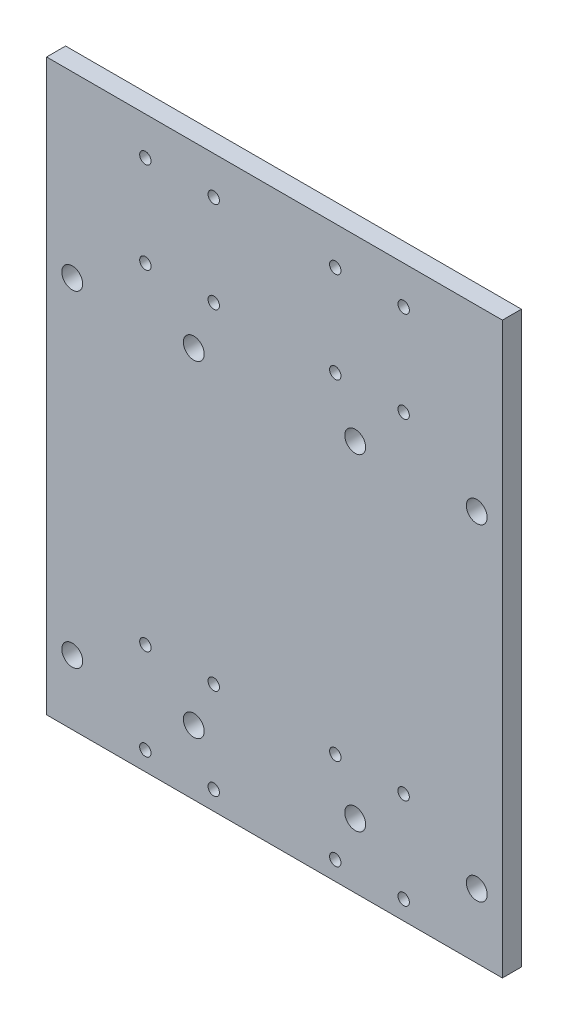
ISO-10303-21;
HEADER;
FILE_DESCRIPTION(('STEP AP214'),'2;1');
FILE_NAME('part.step','',(''),(''),'','','');
FILE_SCHEMA(('AUTOMOTIVE_DESIGN { 1 0 10303 214 1 1 1 1 }'));
ENDSEC;
DATA;
#1=APPLICATION_CONTEXT('core data for automotive mechanical design processes');
#2=APPLICATION_PROTOCOL_DEFINITION('international standard','automotive_design',2000,#1);
#3=PRODUCT_CONTEXT('',#1,'mechanical');
#4=PRODUCT('Part','Part','',(#3));
#5=PRODUCT_RELATED_PRODUCT_CATEGORY('part','',(#4));
#6=PRODUCT_DEFINITION_FORMATION('','',#4);
#7=PRODUCT_DEFINITION_CONTEXT('part definition',#1,'design');
#8=PRODUCT_DEFINITION('design','',#6,#7);
#9=PRODUCT_DEFINITION_SHAPE('','',#8);
#10=(LENGTH_UNIT() NAMED_UNIT(*) SI_UNIT(.MILLI.,.METRE.));
#11=(NAMED_UNIT(*) PLANE_ANGLE_UNIT() SI_UNIT($,.RADIAN.));
#12=(NAMED_UNIT(*) SI_UNIT($,.STERADIAN.) SOLID_ANGLE_UNIT());
#13=UNCERTAINTY_MEASURE_WITH_UNIT(LENGTH_MEASURE(1.E-05),#10,'distance_accuracy_value','');
#14=(GEOMETRIC_REPRESENTATION_CONTEXT(3) GLOBAL_UNCERTAINTY_ASSIGNED_CONTEXT((#13)) GLOBAL_UNIT_ASSIGNED_CONTEXT((#10,
#11,#12)) REPRESENTATION_CONTEXT('',''));
#15=CARTESIAN_POINT('',(0.,0.,0.));
#16=DIRECTION('',(0.,0.,1.));
#17=DIRECTION('',(1.,0.,0.));
#18=AXIS2_PLACEMENT_3D('',#15,#16,#17);
#19=CARTESIAN_POINT('',(-60.,-75.0000000000001,5.));
#20=DIRECTION('',(1.,0.,0.));
#21=DIRECTION('',(0.,0.,-1.));
#22=AXIS2_PLACEMENT_3D('',#19,#20,#21);
#23=PLANE('',#22);
#24=DIRECTION('',(0.,-1.,0.));
#25=VECTOR('',#24,1.);
#26=CARTESIAN_POINT('',(-60.,-75.0000000000001,0.));
#27=LINE('',#26,#25);
#28=CARTESIAN_POINT('',(-60.,75.,0.));
#29=VERTEX_POINT('',#28);
#30=CARTESIAN_POINT('',(-60.,-75.0000000000001,0.));
#31=VERTEX_POINT('',#30);
#32=EDGE_CURVE('E100',#29,#31,#27,.T.);
#33=ORIENTED_EDGE('',*,*,#32,.T.);
#34=DIRECTION('',(0.,0.,-1.));
#35=VECTOR('',#34,1.);
#36=CARTESIAN_POINT('',(-60.,-75.0000000000001,5.));
#37=LINE('',#36,#35);
#38=CARTESIAN_POINT('',(-60.,-75.0000000000001,5.));
#39=VERTEX_POINT('',#38);
#40=EDGE_CURVE('E11',#39,#31,#37,.T.);
#41=ORIENTED_EDGE('',*,*,#40,.F.);
#42=DIRECTION('',(0.,-1.,0.));
#43=VECTOR('',#42,1.);
#44=CARTESIAN_POINT('',(-60.,-75.0000000000001,5.));
#45=LINE('',#44,#43);
#46=CARTESIAN_POINT('',(-60.,75.,5.));
#47=VERTEX_POINT('',#46);
#48=EDGE_CURVE('E88',#47,#39,#45,.T.);
#49=ORIENTED_EDGE('',*,*,#48,.F.);
#50=DIRECTION('',(0.,0.,-1.));
#51=VECTOR('',#50,1.);
#52=CARTESIAN_POINT('',(-60.,75.,5.));
#53=LINE('',#52,#51);
#54=EDGE_CURVE('E96',#47,#29,#53,.T.);
#55=ORIENTED_EDGE('',*,*,#54,.T.);
#56=EDGE_LOOP('',(#33,#41,#49,#55));
#57=FACE_BOUND('',#56,.T.);
#58=ADVANCED_FACE('F37',(#57),#23,.F.);
#59=CARTESIAN_POINT('',(60.,-75.,5.));
#60=DIRECTION('',(0.,1.,0.));
#61=DIRECTION('',(-1.,0.,0.));
#62=AXIS2_PLACEMENT_3D('',#59,#60,#61);
#63=PLANE('',#62);
#64=DIRECTION('',(1.,0.,0.));
#65=VECTOR('',#64,1.);
#66=CARTESIAN_POINT('',(60.,-75.,0.));
#67=LINE('',#66,#65);
#68=CARTESIAN_POINT('',(60.,-75.,0.));
#69=VERTEX_POINT('',#68);
#70=EDGE_CURVE('E92',#31,#69,#67,.T.);
#71=ORIENTED_EDGE('',*,*,#70,.T.);
#72=DIRECTION('',(0.,0.,-1.));
#73=VECTOR('',#72,1.);
#74=CARTESIAN_POINT('',(60.,-75.,5.));
#75=LINE('',#74,#73);
#76=CARTESIAN_POINT('',(60.,-75.,5.));
#77=VERTEX_POINT('',#76);
#78=EDGE_CURVE('E45',#77,#69,#75,.T.);
#79=ORIENTED_EDGE('',*,*,#78,.F.);
#80=DIRECTION('',(1.,0.,0.));
#81=VECTOR('',#80,1.);
#82=CARTESIAN_POINT('',(60.,-75.,5.));
#83=LINE('',#82,#81);
#84=EDGE_CURVE('E83',#39,#77,#83,.T.);
#85=ORIENTED_EDGE('',*,*,#84,.F.);
#86=ORIENTED_EDGE('',*,*,#40,.T.);
#87=EDGE_LOOP('',(#71,#79,#85,#86));
#88=FACE_BOUND('',#87,.T.);
#89=ADVANCED_FACE('F91',(#88),#63,.F.);
#90=CARTESIAN_POINT('',(60.,-75.,5.));
#91=DIRECTION('',(-1.,0.,0.));
#92=DIRECTION('',(0.,0.,1.));
#93=AXIS2_PLACEMENT_3D('',#90,#91,#92);
#94=PLANE('',#93);
#95=DIRECTION('',(0.,1.,0.));
#96=VECTOR('',#95,1.);
#97=CARTESIAN_POINT('',(60.,-75.,0.));
#98=LINE('',#97,#96);
#99=CARTESIAN_POINT('',(60.,75.,0.));
#100=VERTEX_POINT('',#99);
#101=EDGE_CURVE('E70',#69,#100,#98,.T.);
#102=ORIENTED_EDGE('',*,*,#101,.T.);
#103=DIRECTION('',(0.,0.,-1.));
#104=VECTOR('',#103,1.);
#105=CARTESIAN_POINT('',(60.,75.,5.));
#106=LINE('',#105,#104);
#107=CARTESIAN_POINT('',(60.,75.,5.));
#108=VERTEX_POINT('',#107);
#109=EDGE_CURVE('E93',#108,#100,#106,.T.);
#110=ORIENTED_EDGE('',*,*,#109,.F.);
#111=DIRECTION('',(0.,1.,0.));
#112=VECTOR('',#111,1.);
#113=CARTESIAN_POINT('',(60.,-75.,5.));
#114=LINE('',#113,#112);
#115=EDGE_CURVE('E86',#77,#108,#114,.T.);
#116=ORIENTED_EDGE('',*,*,#115,.F.);
#117=ORIENTED_EDGE('',*,*,#78,.T.);
#118=EDGE_LOOP('',(#102,#110,#116,#117));
#119=FACE_BOUND('',#118,.T.);
#120=ADVANCED_FACE('F94',(#119),#94,.F.);
#121=CARTESIAN_POINT('',(60.,75.,5.));
#122=DIRECTION('',(0.,-1.,0.));
#123=DIRECTION('',(1.,0.,0.));
#124=AXIS2_PLACEMENT_3D('',#121,#122,#123);
#125=PLANE('',#124);
#126=DIRECTION('',(-1.,0.,0.));
#127=VECTOR('',#126,1.);
#128=CARTESIAN_POINT('',(60.,75.,0.));
#129=LINE('',#128,#127);
#130=EDGE_CURVE('E76',#100,#29,#129,.T.);
#131=ORIENTED_EDGE('',*,*,#130,.T.);
#132=ORIENTED_EDGE('',*,*,#54,.F.);
#133=DIRECTION('',(-1.,0.,0.));
#134=VECTOR('',#133,1.);
#135=CARTESIAN_POINT('',(60.,75.,5.));
#136=LINE('',#135,#134);
#137=EDGE_CURVE('E53',#108,#47,#136,.T.);
#138=ORIENTED_EDGE('',*,*,#137,.F.);
#139=ORIENTED_EDGE('',*,*,#109,.T.);
#140=EDGE_LOOP('',(#131,#132,#138,#139));
#141=FACE_BOUND('',#140,.T.);
#142=ADVANCED_FACE('F108',(#141),#125,.F.);
#143=CARTESIAN_POINT('',(0.,0.,5.));
#144=DIRECTION('',(0.,0.,1.));
#145=DIRECTION('',(1.,0.,0.));
#146=AXIS2_PLACEMENT_3D('',#143,#144,#145);
#147=PLANE('',#146);
#148=CARTESIAN_POINT('',(16.0000000000002,-45.9999999999992,5.));
#149=DIRECTION('',(0.,0.,-1.));
#150=DIRECTION('',(-1.,0.,0.));
#151=AXIS2_PLACEMENT_3D('',#148,#149,#150);
#152=CIRCLE('',#151,1.5);
#153=CARTESIAN_POINT('',(14.5000000000002,-45.9999999999992,5.));
#154=VERTEX_POINT('',#153);
#155=EDGE_CURVE('E184',#154,#154,#152,.T.);
#156=ORIENTED_EDGE('',*,*,#155,.T.);
#157=EDGE_LOOP('',(#156));
#158=FACE_BOUND('',#157,.T.);
#159=CARTESIAN_POINT('',(34.0000000000003,-69.9999999999991,5.));
#160=DIRECTION('',(0.,0.,-1.));
#161=DIRECTION('',(-1.,0.,0.));
#162=AXIS2_PLACEMENT_3D('',#159,#160,#161);
#163=CIRCLE('',#162,1.5);
#164=CARTESIAN_POINT('',(32.5000000000002,-69.9999999999991,5.));
#165=VERTEX_POINT('',#164);
#166=EDGE_CURVE('E195',#165,#165,#163,.T.);
#167=ORIENTED_EDGE('',*,*,#166,.T.);
#168=EDGE_LOOP('',(#167));
#169=FACE_BOUND('',#168,.T.);
#170=CARTESIAN_POINT('',(34.0000000000002,-45.9999999999991,5.));
#171=DIRECTION('',(0.,0.,-1.));
#172=DIRECTION('',(-1.,0.,0.));
#173=AXIS2_PLACEMENT_3D('',#170,#171,#172);
#174=CIRCLE('',#173,1.5);
#175=CARTESIAN_POINT('',(32.5000000000002,-45.9999999999991,5.));
#176=VERTEX_POINT('',#175);
#177=EDGE_CURVE('E196',#176,#176,#174,.T.);
#178=ORIENTED_EDGE('',*,*,#177,.T.);
#179=EDGE_LOOP('',(#178));
#180=FACE_BOUND('',#179,.T.);
#181=CARTESIAN_POINT('',(15.9999999999999,41.,5.));
#182=DIRECTION('',(0.,0.,-1.));
#183=DIRECTION('',(-1.,0.,0.));
#184=AXIS2_PLACEMENT_3D('',#181,#182,#183);
#185=CIRCLE('',#184,1.5);
#186=CARTESIAN_POINT('',(14.4999999999999,41.,5.));
#187=VERTEX_POINT('',#186);
#188=EDGE_CURVE('E207',#187,#187,#185,.T.);
#189=ORIENTED_EDGE('',*,*,#188,.T.);
#190=EDGE_LOOP('',(#189));
#191=FACE_BOUND('',#190,.T.);
#192=CARTESIAN_POINT('',(-33.9999999999998,-45.9999999999994,5.));
#193=DIRECTION('',(0.,0.,-1.));
#194=DIRECTION('',(-1.,0.,0.));
#195=AXIS2_PLACEMENT_3D('',#192,#193,#194);
#196=CIRCLE('',#195,1.5);
#197=CARTESIAN_POINT('',(-35.4999999999998,-45.9999999999994,5.));
#198=VERTEX_POINT('',#197);
#199=EDGE_CURVE('E165',#198,#198,#196,.T.);
#200=ORIENTED_EDGE('',*,*,#199,.T.);
#201=EDGE_LOOP('',(#200));
#202=FACE_BOUND('',#201,.T.);
#203=CARTESIAN_POINT('',(-15.9999999999997,-69.9999999999993,5.));
#204=DIRECTION('',(0.,0.,-1.));
#205=DIRECTION('',(-1.,0.,0.));
#206=AXIS2_PLACEMENT_3D('',#203,#204,#205);
#207=CIRCLE('',#206,1.5);
#208=CARTESIAN_POINT('',(-17.4999999999997,-69.9999999999993,5.));
#209=VERTEX_POINT('',#208);
#210=EDGE_CURVE('E171',#209,#209,#207,.T.);
#211=ORIENTED_EDGE('',*,*,#210,.T.);
#212=EDGE_LOOP('',(#211));
#213=FACE_BOUND('',#212,.T.);
#214=CARTESIAN_POINT('',(-15.9999999999998,-45.9999999999993,5.));
#215=DIRECTION('',(0.,0.,-1.));
#216=DIRECTION('',(-1.,0.,0.));
#217=AXIS2_PLACEMENT_3D('',#214,#215,#216);
#218=CIRCLE('',#217,1.5);
#219=CARTESIAN_POINT('',(-17.4999999999998,-45.9999999999993,5.));
#220=VERTEX_POINT('',#219);
#221=EDGE_CURVE('E172',#220,#220,#218,.T.);
#222=ORIENTED_EDGE('',*,*,#221,.T.);
#223=EDGE_LOOP('',(#222));
#224=FACE_BOUND('',#223,.T.);
#225=CARTESIAN_POINT('',(16.0000000000003,-69.9999999999992,5.));
#226=DIRECTION('',(0.,0.,-1.));
#227=DIRECTION('',(-1.,0.,0.));
#228=AXIS2_PLACEMENT_3D('',#225,#226,#227);
#229=CIRCLE('',#228,1.5);
#230=CARTESIAN_POINT('',(14.5000000000003,-69.9999999999992,5.));
#231=VERTEX_POINT('',#230);
#232=EDGE_CURVE('E183',#231,#231,#229,.T.);
#233=ORIENTED_EDGE('',*,*,#232,.T.);
#234=EDGE_LOOP('',(#233));
#235=FACE_BOUND('',#234,.T.);
#236=CARTESIAN_POINT('',(-34.0000000000002,64.9999999999998,5.));
#237=DIRECTION('',(0.,0.,-1.));
#238=DIRECTION('',(-1.,0.,0.));
#239=AXIS2_PLACEMENT_3D('',#236,#237,#238);
#240=CIRCLE('',#239,1.5);
#241=CARTESIAN_POINT('',(-35.5000000000002,64.9999999999998,5.));
#242=VERTEX_POINT('',#241);
#243=EDGE_CURVE('E232',#242,#242,#240,.T.);
#244=ORIENTED_EDGE('',*,*,#243,.T.);
#245=EDGE_LOOP('',(#244));
#246=FACE_BOUND('',#245,.T.);
#247=CARTESIAN_POINT('',(-16.0000000000001,40.9999999999999,5.));
#248=DIRECTION('',(0.,0.,-1.));
#249=DIRECTION('',(-1.,0.,0.));
#250=AXIS2_PLACEMENT_3D('',#247,#248,#249);
#251=CIRCLE('',#250,1.5);
#252=CARTESIAN_POINT('',(-17.5000000000001,40.9999999999999,5.));
#253=VERTEX_POINT('',#252);
#254=EDGE_CURVE('E243',#253,#253,#251,.T.);
#255=ORIENTED_EDGE('',*,*,#254,.T.);
#256=EDGE_LOOP('',(#255));
#257=FACE_BOUND('',#256,.T.);
#258=CARTESIAN_POINT('',(-16.0000000000002,64.9999999999999,5.));
#259=DIRECTION('',(0.,0.,-1.));
#260=DIRECTION('',(-1.,0.,0.));
#261=AXIS2_PLACEMENT_3D('',#258,#259,#260);
#262=CIRCLE('',#261,1.5);
#263=CARTESIAN_POINT('',(-17.5000000000002,64.9999999999999,5.));
#264=VERTEX_POINT('',#263);
#265=EDGE_CURVE('E244',#264,#264,#262,.T.);
#266=ORIENTED_EDGE('',*,*,#265,.T.);
#267=EDGE_LOOP('',(#266));
#268=FACE_BOUND('',#267,.T.);
#269=CARTESIAN_POINT('',(15.9999999999998,65.,5.));
#270=DIRECTION('',(0.,0.,-1.));
#271=DIRECTION('',(-1.,0.,0.));
#272=AXIS2_PLACEMENT_3D('',#269,#270,#271);
#273=CIRCLE('',#272,1.5);
#274=CARTESIAN_POINT('',(14.4999999999998,65.,5.));
#275=VERTEX_POINT('',#274);
#276=EDGE_CURVE('E208',#275,#275,#273,.T.);
#277=ORIENTED_EDGE('',*,*,#276,.T.);
#278=EDGE_LOOP('',(#277));
#279=FACE_BOUND('',#278,.T.);
#280=CARTESIAN_POINT('',(33.9999999999999,41.0000000000001,5.));
#281=DIRECTION('',(0.,0.,-1.));
#282=DIRECTION('',(-1.,0.,0.));
#283=AXIS2_PLACEMENT_3D('',#280,#281,#282);
#284=CIRCLE('',#283,1.5);
#285=CARTESIAN_POINT('',(32.4999999999999,41.0000000000001,5.));
#286=VERTEX_POINT('',#285);
#287=EDGE_CURVE('E219',#286,#286,#284,.T.);
#288=ORIENTED_EDGE('',*,*,#287,.T.);
#289=EDGE_LOOP('',(#288));
#290=FACE_BOUND('',#289,.T.);
#291=CARTESIAN_POINT('',(33.9999999999998,65.0000000000001,5.));
#292=DIRECTION('',(0.,0.,-1.));
#293=DIRECTION('',(-1.,0.,0.));
#294=AXIS2_PLACEMENT_3D('',#291,#292,#293);
#295=CIRCLE('',#294,1.5);
#296=CARTESIAN_POINT('',(32.4999999999998,65.0000000000001,5.));
#297=VERTEX_POINT('',#296);
#298=EDGE_CURVE('E220',#297,#297,#295,.T.);
#299=ORIENTED_EDGE('',*,*,#298,.T.);
#300=EDGE_LOOP('',(#299));
#301=FACE_BOUND('',#300,.T.);
#302=CARTESIAN_POINT('',(-34.0000000000001,40.9999999999998,5.));
#303=DIRECTION('',(0.,0.,-1.));
#304=DIRECTION('',(-1.,0.,0.));
#305=AXIS2_PLACEMENT_3D('',#302,#303,#304);
#306=CIRCLE('',#305,1.5);
#307=CARTESIAN_POINT('',(-35.5000000000001,40.9999999999998,5.));
#308=VERTEX_POINT('',#307);
#309=EDGE_CURVE('E231',#308,#308,#306,.T.);
#310=ORIENTED_EDGE('',*,*,#309,.T.);
#311=EDGE_LOOP('',(#310));
#312=FACE_BOUND('',#311,.T.);
#313=CARTESIAN_POINT('',(-33.9999999999997,-69.9999999999994,5.));
#314=DIRECTION('',(0.,0.,-1.));
#315=DIRECTION('',(-1.,0.,0.));
#316=AXIS2_PLACEMENT_3D('',#313,#314,#315);
#317=CIRCLE('',#316,1.5);
#318=CARTESIAN_POINT('',(-35.4999999999997,-69.9999999999994,5.));
#319=VERTEX_POINT('',#318);
#320=EDGE_CURVE('E159',#319,#319,#317,.T.);
#321=ORIENTED_EDGE('',*,*,#320,.T.);
#322=EDGE_LOOP('',(#321));
#323=FACE_BOUND('',#322,.T.);
#324=CARTESIAN_POINT('',(53.2500000000004,-57.9999999999989,5.));
#325=DIRECTION('',(0.,0.,1.));
#326=DIRECTION('',(1.,0.,0.));
#327=AXIS2_PLACEMENT_3D('',#324,#325,#326);
#328=CIRCLE('',#327,2.75);
#329=CARTESIAN_POINT('',(56.0000000000004,-57.9999999999989,5.));
#330=VERTEX_POINT('',#329);
#331=EDGE_CURVE('E132',#330,#330,#328,.T.);
#332=ORIENTED_EDGE('',*,*,#331,.F.);
#333=EDGE_LOOP('',(#332));
#334=FACE_BOUND('',#333,.T.);
#335=CARTESIAN_POINT('',(-21.2499999999997,-57.9999999999994,5.));
#336=DIRECTION('',(0.,0.,1.));
#337=DIRECTION('',(1.,0.,0.));
#338=AXIS2_PLACEMENT_3D('',#335,#336,#337);
#339=CIRCLE('',#338,2.75);
#340=CARTESIAN_POINT('',(-18.4999999999997,-57.9999999999994,5.));
#341=VERTEX_POINT('',#340);
#342=EDGE_CURVE('E139',#341,#341,#339,.T.);
#343=ORIENTED_EDGE('',*,*,#342,.F.);
#344=EDGE_LOOP('',(#343));
#345=FACE_BOUND('',#344,.T.);
#346=CARTESIAN_POINT('',(-53.2499999999997,-57.9999999999996,5.));
#347=DIRECTION('',(0.,0.,1.));
#348=DIRECTION('',(1.,0.,0.));
#349=AXIS2_PLACEMENT_3D('',#346,#347,#348);
#350=CIRCLE('',#349,2.75);
#351=CARTESIAN_POINT('',(-50.4999999999997,-57.9999999999996,5.));
#352=VERTEX_POINT('',#351);
#353=EDGE_CURVE('E120',#352,#352,#350,.T.);
#354=ORIENTED_EDGE('',*,*,#353,.F.);
#355=EDGE_LOOP('',(#354));
#356=FACE_BOUND('',#355,.T.);
#357=CARTESIAN_POINT('',(-21.2500000000003,28.0000000000006,5.));
#358=DIRECTION('',(0.,0.,1.));
#359=DIRECTION('',(1.,0.,0.));
#360=AXIS2_PLACEMENT_3D('',#357,#358,#359);
#361=CIRCLE('',#360,2.75);
#362=CARTESIAN_POINT('',(-18.5000000000003,28.0000000000006,5.));
#363=VERTEX_POINT('',#362);
#364=EDGE_CURVE('E127',#363,#363,#361,.T.);
#365=ORIENTED_EDGE('',*,*,#364,.F.);
#366=EDGE_LOOP('',(#365));
#367=FACE_BOUND('',#366,.T.);
#368=CARTESIAN_POINT('',(21.2499999999998,28.0000000000009,5.));
#369=DIRECTION('',(0.,0.,1.));
#370=DIRECTION('',(1.,0.,0.));
#371=AXIS2_PLACEMENT_3D('',#368,#369,#370);
#372=CIRCLE('',#371,2.75);
#373=CARTESIAN_POINT('',(23.9999999999998,28.0000000000009,5.));
#374=VERTEX_POINT('',#373);
#375=EDGE_CURVE('E156',#374,#374,#372,.T.);
#376=ORIENTED_EDGE('',*,*,#375,.F.);
#377=EDGE_LOOP('',(#376));
#378=FACE_BOUND('',#377,.T.);
#379=CARTESIAN_POINT('',(53.2499999999998,28.0000000000011,5.));
#380=DIRECTION('',(0.,0.,1.));
#381=DIRECTION('',(1.,0.,0.));
#382=AXIS2_PLACEMENT_3D('',#379,#380,#381);
#383=CIRCLE('',#382,2.74999999999999);
#384=CARTESIAN_POINT('',(55.9999999999998,28.0000000000011,5.));
#385=VERTEX_POINT('',#384);
#386=EDGE_CURVE('E144',#385,#385,#383,.T.);
#387=ORIENTED_EDGE('',*,*,#386,.F.);
#388=EDGE_LOOP('',(#387));
#389=FACE_BOUND('',#388,.T.);
#390=CARTESIAN_POINT('',(21.2500000000004,-57.9999999999991,5.));
#391=DIRECTION('',(0.,0.,1.));
#392=DIRECTION('',(1.,0.,0.));
#393=AXIS2_PLACEMENT_3D('',#390,#391,#392);
#394=CIRCLE('',#393,2.75);
#395=CARTESIAN_POINT('',(24.0000000000004,-57.9999999999991,5.));
#396=VERTEX_POINT('',#395);
#397=EDGE_CURVE('E151',#396,#396,#394,.T.);
#398=ORIENTED_EDGE('',*,*,#397,.F.);
#399=EDGE_LOOP('',(#398));
#400=FACE_BOUND('',#399,.T.);
#401=CARTESIAN_POINT('',(-53.2500000000003,28.0000000000004,5.));
#402=DIRECTION('',(0.,0.,1.));
#403=DIRECTION('',(1.,0.,0.));
#404=AXIS2_PLACEMENT_3D('',#401,#402,#403);
#405=CIRCLE('',#404,2.74999999999999);
#406=CARTESIAN_POINT('',(-50.5000000000003,28.0000000000004,5.));
#407=VERTEX_POINT('',#406);
#408=EDGE_CURVE('E114',#407,#407,#405,.T.);
#409=ORIENTED_EDGE('',*,*,#408,.F.);
#410=EDGE_LOOP('',(#409));
#411=FACE_BOUND('',#410,.T.);
#412=ORIENTED_EDGE('',*,*,#48,.T.);
#413=ORIENTED_EDGE('',*,*,#84,.T.);
#414=ORIENTED_EDGE('',*,*,#115,.T.);
#415=ORIENTED_EDGE('',*,*,#137,.T.);
#416=EDGE_LOOP('',(#412,#413,#414,#415));
#417=FACE_BOUND('',#416,.T.);
#418=ADVANCED_FACE('F84',(#158,#169,#180,#191,#202,#213,#224,#235,#246,#257,#268,#279,#290,#301,
#312,#323,#334,#345,#356,#367,#378,#389,#400,#411,#417),#147,.T.);
#419=CARTESIAN_POINT('',(0.,0.,0.));
#420=DIRECTION('',(0.,0.,1.));
#421=DIRECTION('',(1.,0.,0.));
#422=AXIS2_PLACEMENT_3D('',#419,#420,#421);
#423=PLANE('',#422);
#424=CARTESIAN_POINT('',(16.0000000000002,-45.9999999999992,0.));
#425=DIRECTION('',(0.,0.,-1.));
#426=DIRECTION('',(-1.,0.,0.));
#427=AXIS2_PLACEMENT_3D('',#424,#425,#426);
#428=CIRCLE('',#427,1.5);
#429=CARTESIAN_POINT('',(14.5000000000002,-45.9999999999992,0.));
#430=VERTEX_POINT('',#429);
#431=EDGE_CURVE('E199',#430,#430,#428,.T.);
#432=ORIENTED_EDGE('',*,*,#431,.F.);
#433=EDGE_LOOP('',(#432));
#434=FACE_BOUND('',#433,.T.);
#435=CARTESIAN_POINT('',(34.0000000000003,-69.9999999999991,0.));
#436=DIRECTION('',(0.,0.,-1.));
#437=DIRECTION('',(-1.,0.,0.));
#438=AXIS2_PLACEMENT_3D('',#435,#436,#437);
#439=CIRCLE('',#438,1.5);
#440=CARTESIAN_POINT('',(32.5000000000002,-69.9999999999991,0.));
#441=VERTEX_POINT('',#440);
#442=EDGE_CURVE('E192',#441,#441,#439,.T.);
#443=ORIENTED_EDGE('',*,*,#442,.F.);
#444=EDGE_LOOP('',(#443));
#445=FACE_BOUND('',#444,.T.);
#446=CARTESIAN_POINT('',(34.0000000000002,-45.9999999999991,0.));
#447=DIRECTION('',(0.,0.,-1.));
#448=DIRECTION('',(-1.,0.,0.));
#449=AXIS2_PLACEMENT_3D('',#446,#447,#448);
#450=CIRCLE('',#449,1.5);
#451=CARTESIAN_POINT('',(32.5000000000002,-45.9999999999991,0.));
#452=VERTEX_POINT('',#451);
#453=EDGE_CURVE('E211',#452,#452,#450,.T.);
#454=ORIENTED_EDGE('',*,*,#453,.F.);
#455=EDGE_LOOP('',(#454));
#456=FACE_BOUND('',#455,.T.);
#457=CARTESIAN_POINT('',(15.9999999999999,41.,0.));
#458=DIRECTION('',(0.,0.,-1.));
#459=DIRECTION('',(-1.,0.,0.));
#460=AXIS2_PLACEMENT_3D('',#457,#458,#459);
#461=CIRCLE('',#460,1.5);
#462=CARTESIAN_POINT('',(14.4999999999999,41.,0.));
#463=VERTEX_POINT('',#462);
#464=EDGE_CURVE('E204',#463,#463,#461,.T.);
#465=ORIENTED_EDGE('',*,*,#464,.F.);
#466=EDGE_LOOP('',(#465));
#467=FACE_BOUND('',#466,.T.);
#468=CARTESIAN_POINT('',(-33.9999999999998,-45.9999999999994,0.));
#469=DIRECTION('',(0.,0.,-1.));
#470=DIRECTION('',(-1.,0.,0.));
#471=AXIS2_PLACEMENT_3D('',#468,#469,#470);
#472=CIRCLE('',#471,1.5);
#473=CARTESIAN_POINT('',(-35.4999999999998,-45.9999999999994,0.));
#474=VERTEX_POINT('',#473);
#475=EDGE_CURVE('E175',#474,#474,#472,.T.);
#476=ORIENTED_EDGE('',*,*,#475,.F.);
#477=EDGE_LOOP('',(#476));
#478=FACE_BOUND('',#477,.T.);
#479=CARTESIAN_POINT('',(-15.9999999999997,-69.9999999999993,0.));
#480=DIRECTION('',(0.,0.,-1.));
#481=DIRECTION('',(-1.,0.,0.));
#482=AXIS2_PLACEMENT_3D('',#479,#480,#481);
#483=CIRCLE('',#482,1.5);
#484=CARTESIAN_POINT('',(-17.4999999999997,-69.9999999999993,0.));
#485=VERTEX_POINT('',#484);
#486=EDGE_CURVE('E168',#485,#485,#483,.T.);
#487=ORIENTED_EDGE('',*,*,#486,.F.);
#488=EDGE_LOOP('',(#487));
#489=FACE_BOUND('',#488,.T.);
#490=CARTESIAN_POINT('',(-15.9999999999998,-45.9999999999993,0.));
#491=DIRECTION('',(0.,0.,-1.));
#492=DIRECTION('',(-1.,0.,0.));
#493=AXIS2_PLACEMENT_3D('',#490,#491,#492);
#494=CIRCLE('',#493,1.5);
#495=CARTESIAN_POINT('',(-17.4999999999998,-45.9999999999993,0.));
#496=VERTEX_POINT('',#495);
#497=EDGE_CURVE('E187',#496,#496,#494,.T.);
#498=ORIENTED_EDGE('',*,*,#497,.F.);
#499=EDGE_LOOP('',(#498));
#500=FACE_BOUND('',#499,.T.);
#501=CARTESIAN_POINT('',(16.0000000000003,-69.9999999999992,0.));
#502=DIRECTION('',(0.,0.,-1.));
#503=DIRECTION('',(-1.,0.,0.));
#504=AXIS2_PLACEMENT_3D('',#501,#502,#503);
#505=CIRCLE('',#504,1.5);
#506=CARTESIAN_POINT('',(14.5000000000003,-69.9999999999992,0.));
#507=VERTEX_POINT('',#506);
#508=EDGE_CURVE('E180',#507,#507,#505,.T.);
#509=ORIENTED_EDGE('',*,*,#508,.F.);
#510=EDGE_LOOP('',(#509));
#511=FACE_BOUND('',#510,.T.);
#512=CARTESIAN_POINT('',(-34.0000000000002,64.9999999999998,0.));
#513=DIRECTION('',(0.,0.,-1.));
#514=DIRECTION('',(-1.,0.,0.));
#515=AXIS2_PLACEMENT_3D('',#512,#513,#514);
#516=CIRCLE('',#515,1.5);
#517=CARTESIAN_POINT('',(-35.5000000000002,64.9999999999998,0.));
#518=VERTEX_POINT('',#517);
#519=EDGE_CURVE('E247',#518,#518,#516,.T.);
#520=ORIENTED_EDGE('',*,*,#519,.F.);
#521=EDGE_LOOP('',(#520));
#522=FACE_BOUND('',#521,.T.);
#523=CARTESIAN_POINT('',(-16.0000000000001,40.9999999999999,0.));
#524=DIRECTION('',(0.,0.,-1.));
#525=DIRECTION('',(-1.,0.,0.));
#526=AXIS2_PLACEMENT_3D('',#523,#524,#525);
#527=CIRCLE('',#526,1.5);
#528=CARTESIAN_POINT('',(-17.5000000000001,40.9999999999999,0.));
#529=VERTEX_POINT('',#528);
#530=EDGE_CURVE('E240',#529,#529,#527,.T.);
#531=ORIENTED_EDGE('',*,*,#530,.F.);
#532=EDGE_LOOP('',(#531));
#533=FACE_BOUND('',#532,.T.);
#534=CARTESIAN_POINT('',(-16.0000000000002,64.9999999999999,0.));
#535=DIRECTION('',(0.,0.,-1.));
#536=DIRECTION('',(-1.,0.,0.));
#537=AXIS2_PLACEMENT_3D('',#534,#535,#536);
#538=CIRCLE('',#537,1.5);
#539=CARTESIAN_POINT('',(-17.5000000000002,64.9999999999999,0.));
#540=VERTEX_POINT('',#539);
#541=EDGE_CURVE('E252',#540,#540,#538,.T.);
#542=ORIENTED_EDGE('',*,*,#541,.F.);
#543=EDGE_LOOP('',(#542));
#544=FACE_BOUND('',#543,.T.);
#545=CARTESIAN_POINT('',(15.9999999999998,65.,0.));
#546=DIRECTION('',(0.,0.,-1.));
#547=DIRECTION('',(-1.,0.,0.));
#548=AXIS2_PLACEMENT_3D('',#545,#546,#547);
#549=CIRCLE('',#548,1.5);
#550=CARTESIAN_POINT('',(14.4999999999998,65.,0.));
#551=VERTEX_POINT('',#550);
#552=EDGE_CURVE('E223',#551,#551,#549,.T.);
#553=ORIENTED_EDGE('',*,*,#552,.F.);
#554=EDGE_LOOP('',(#553));
#555=FACE_BOUND('',#554,.T.);
#556=CARTESIAN_POINT('',(33.9999999999999,41.0000000000001,0.));
#557=DIRECTION('',(0.,0.,-1.));
#558=DIRECTION('',(-1.,0.,0.));
#559=AXIS2_PLACEMENT_3D('',#556,#557,#558);
#560=CIRCLE('',#559,1.5);
#561=CARTESIAN_POINT('',(32.4999999999999,41.0000000000001,0.));
#562=VERTEX_POINT('',#561);
#563=EDGE_CURVE('E216',#562,#562,#560,.T.);
#564=ORIENTED_EDGE('',*,*,#563,.F.);
#565=EDGE_LOOP('',(#564));
#566=FACE_BOUND('',#565,.T.);
#567=CARTESIAN_POINT('',(33.9999999999998,65.0000000000001,0.));
#568=DIRECTION('',(0.,0.,-1.));
#569=DIRECTION('',(-1.,0.,0.));
#570=AXIS2_PLACEMENT_3D('',#567,#568,#569);
#571=CIRCLE('',#570,1.5);
#572=CARTESIAN_POINT('',(32.4999999999998,65.0000000000001,0.));
#573=VERTEX_POINT('',#572);
#574=EDGE_CURVE('E235',#573,#573,#571,.T.);
#575=ORIENTED_EDGE('',*,*,#574,.F.);
#576=EDGE_LOOP('',(#575));
#577=FACE_BOUND('',#576,.T.);
#578=CARTESIAN_POINT('',(-34.0000000000001,40.9999999999998,0.));
#579=DIRECTION('',(0.,0.,-1.));
#580=DIRECTION('',(-1.,0.,0.));
#581=AXIS2_PLACEMENT_3D('',#578,#579,#580);
#582=CIRCLE('',#581,1.5);
#583=CARTESIAN_POINT('',(-35.5000000000001,40.9999999999998,0.));
#584=VERTEX_POINT('',#583);
#585=EDGE_CURVE('E228',#584,#584,#582,.T.);
#586=ORIENTED_EDGE('',*,*,#585,.F.);
#587=EDGE_LOOP('',(#586));
#588=FACE_BOUND('',#587,.T.);
#589=CARTESIAN_POINT('',(-33.9999999999997,-69.9999999999994,0.));
#590=DIRECTION('',(0.,0.,-1.));
#591=DIRECTION('',(-1.,0.,0.));
#592=AXIS2_PLACEMENT_3D('',#589,#590,#591);
#593=CIRCLE('',#592,1.5);
#594=CARTESIAN_POINT('',(-35.4999999999997,-69.9999999999994,0.));
#595=VERTEX_POINT('',#594);
#596=EDGE_CURVE('E162',#595,#595,#593,.T.);
#597=ORIENTED_EDGE('',*,*,#596,.F.);
#598=EDGE_LOOP('',(#597));
#599=FACE_BOUND('',#598,.T.);
#600=CARTESIAN_POINT('',(53.2500000000004,-57.9999999999989,0.));
#601=DIRECTION('',(0.,0.,1.));
#602=DIRECTION('',(1.,0.,0.));
#603=AXIS2_PLACEMENT_3D('',#600,#601,#602);
#604=CIRCLE('',#603,2.75);
#605=CARTESIAN_POINT('',(56.0000000000004,-57.9999999999989,0.));
#606=VERTEX_POINT('',#605);
#607=EDGE_CURVE('E135',#606,#606,#604,.T.);
#608=ORIENTED_EDGE('',*,*,#607,.T.);
#609=EDGE_LOOP('',(#608));
#610=FACE_BOUND('',#609,.T.);
#611=CARTESIAN_POINT('',(-21.2499999999997,-57.9999999999994,0.));
#612=DIRECTION('',(0.,0.,1.));
#613=DIRECTION('',(1.,0.,0.));
#614=AXIS2_PLACEMENT_3D('',#611,#612,#613);
#615=CIRCLE('',#614,2.75);
#616=CARTESIAN_POINT('',(-18.4999999999997,-57.9999999999994,0.));
#617=VERTEX_POINT('',#616);
#618=EDGE_CURVE('E124',#617,#617,#615,.T.);
#619=ORIENTED_EDGE('',*,*,#618,.T.);
#620=EDGE_LOOP('',(#619));
#621=FACE_BOUND('',#620,.T.);
#622=CARTESIAN_POINT('',(-53.2499999999997,-57.9999999999996,0.));
#623=DIRECTION('',(0.,0.,1.));
#624=DIRECTION('',(1.,0.,0.));
#625=AXIS2_PLACEMENT_3D('',#622,#623,#624);
#626=CIRCLE('',#625,2.75);
#627=CARTESIAN_POINT('',(-50.4999999999997,-57.9999999999996,0.));
#628=VERTEX_POINT('',#627);
#629=EDGE_CURVE('E123',#628,#628,#626,.T.);
#630=ORIENTED_EDGE('',*,*,#629,.T.);
#631=EDGE_LOOP('',(#630));
#632=FACE_BOUND('',#631,.T.);
#633=CARTESIAN_POINT('',(-21.2500000000003,28.0000000000006,0.));
#634=DIRECTION('',(0.,0.,1.));
#635=DIRECTION('',(1.,0.,0.));
#636=AXIS2_PLACEMENT_3D('',#633,#634,#635);
#637=CIRCLE('',#636,2.75);
#638=CARTESIAN_POINT('',(-18.5000000000003,28.0000000000006,0.));
#639=VERTEX_POINT('',#638);
#640=EDGE_CURVE('E117',#639,#639,#637,.T.);
#641=ORIENTED_EDGE('',*,*,#640,.T.);
#642=EDGE_LOOP('',(#641));
#643=FACE_BOUND('',#642,.T.);
#644=CARTESIAN_POINT('',(21.2499999999998,28.0000000000009,0.));
#645=DIRECTION('',(0.,0.,1.));
#646=DIRECTION('',(1.,0.,0.));
#647=AXIS2_PLACEMENT_3D('',#644,#645,#646);
#648=CIRCLE('',#647,2.75);
#649=CARTESIAN_POINT('',(23.9999999999998,28.0000000000009,0.));
#650=VERTEX_POINT('',#649);
#651=EDGE_CURVE('E148',#650,#650,#648,.T.);
#652=ORIENTED_EDGE('',*,*,#651,.T.);
#653=EDGE_LOOP('',(#652));
#654=FACE_BOUND('',#653,.T.);
#655=CARTESIAN_POINT('',(53.2499999999998,28.0000000000011,0.));
#656=DIRECTION('',(0.,0.,1.));
#657=DIRECTION('',(1.,0.,0.));
#658=AXIS2_PLACEMENT_3D('',#655,#656,#657);
#659=CIRCLE('',#658,2.74999999999999);
#660=CARTESIAN_POINT('',(55.9999999999998,28.0000000000011,0.));
#661=VERTEX_POINT('',#660);
#662=EDGE_CURVE('E147',#661,#661,#659,.T.);
#663=ORIENTED_EDGE('',*,*,#662,.T.);
#664=EDGE_LOOP('',(#663));
#665=FACE_BOUND('',#664,.T.);
#666=CARTESIAN_POINT('',(21.2500000000004,-57.9999999999991,0.));
#667=DIRECTION('',(0.,0.,1.));
#668=DIRECTION('',(1.,0.,0.));
#669=AXIS2_PLACEMENT_3D('',#666,#667,#668);
#670=CIRCLE('',#669,2.75);
#671=CARTESIAN_POINT('',(24.0000000000004,-57.9999999999991,0.));
#672=VERTEX_POINT('',#671);
#673=EDGE_CURVE('E136',#672,#672,#670,.T.);
#674=ORIENTED_EDGE('',*,*,#673,.T.);
#675=EDGE_LOOP('',(#674));
#676=FACE_BOUND('',#675,.T.);
#677=CARTESIAN_POINT('',(-53.2500000000003,28.0000000000004,0.));
#678=DIRECTION('',(0.,0.,1.));
#679=DIRECTION('',(1.,0.,0.));
#680=AXIS2_PLACEMENT_3D('',#677,#678,#679);
#681=CIRCLE('',#680,2.74999999999999);
#682=CARTESIAN_POINT('',(-50.5000000000003,28.0000000000004,0.));
#683=VERTEX_POINT('',#682);
#684=EDGE_CURVE('E103',#683,#683,#681,.T.);
#685=ORIENTED_EDGE('',*,*,#684,.T.);
#686=EDGE_LOOP('',(#685));
#687=FACE_BOUND('',#686,.T.);
#688=ORIENTED_EDGE('',*,*,#32,.F.);
#689=ORIENTED_EDGE('',*,*,#130,.F.);
#690=ORIENTED_EDGE('',*,*,#101,.F.);
#691=ORIENTED_EDGE('',*,*,#70,.F.);
#692=EDGE_LOOP('',(#688,#689,#690,#691));
#693=FACE_BOUND('',#692,.T.);
#694=ADVANCED_FACE('F111',(#434,#445,#456,#467,#478,#489,#500,#511,#522,#533,#544,#555,#566,
#577,#588,#599,#610,#621,#632,#643,#654,#665,#676,#687,#693),#423,.F.);
#695=CARTESIAN_POINT('',(-53.2500000000003,28.0000000000004,0.));
#696=DIRECTION('',(0.,0.,1.));
#697=DIRECTION('',(1.,0.,0.));
#698=AXIS2_PLACEMENT_3D('',#695,#696,#697);
#699=CYLINDRICAL_SURFACE('',#698,2.74999999999999);
#700=ORIENTED_EDGE('',*,*,#684,.F.);
#701=EDGE_LOOP('',(#700));
#702=FACE_BOUND('',#701,.T.);
#703=ORIENTED_EDGE('',*,*,#408,.T.);
#704=EDGE_LOOP('',(#703));
#705=FACE_BOUND('',#704,.T.);
#706=ADVANCED_FACE('F270',(#702,#705),#699,.F.);
#707=CARTESIAN_POINT('',(21.2500000000004,-57.9999999999991,0.));
#708=DIRECTION('',(0.,0.,1.));
#709=DIRECTION('',(1.,0.,0.));
#710=AXIS2_PLACEMENT_3D('',#707,#708,#709);
#711=CYLINDRICAL_SURFACE('',#710,2.75);
#712=ORIENTED_EDGE('',*,*,#673,.F.);
#713=EDGE_LOOP('',(#712));
#714=FACE_BOUND('',#713,.T.);
#715=ORIENTED_EDGE('',*,*,#397,.T.);
#716=EDGE_LOOP('',(#715));
#717=FACE_BOUND('',#716,.T.);
#718=ADVANCED_FACE('F301',(#714,#717),#711,.F.);
#719=CARTESIAN_POINT('',(53.2499999999998,28.0000000000011,0.));
#720=DIRECTION('',(0.,0.,1.));
#721=DIRECTION('',(1.,0.,0.));
#722=AXIS2_PLACEMENT_3D('',#719,#720,#721);
#723=CYLINDRICAL_SURFACE('',#722,2.74999999999999);
#724=ORIENTED_EDGE('',*,*,#662,.F.);
#725=EDGE_LOOP('',(#724));
#726=FACE_BOUND('',#725,.T.);
#727=ORIENTED_EDGE('',*,*,#386,.T.);
#728=EDGE_LOOP('',(#727));
#729=FACE_BOUND('',#728,.T.);
#730=ADVANCED_FACE('F349',(#726,#729),#723,.F.);
#731=CARTESIAN_POINT('',(21.2499999999998,28.0000000000009,0.));
#732=DIRECTION('',(0.,0.,1.));
#733=DIRECTION('',(1.,0.,0.));
#734=AXIS2_PLACEMENT_3D('',#731,#732,#733);
#735=CYLINDRICAL_SURFACE('',#734,2.75);
#736=ORIENTED_EDGE('',*,*,#651,.F.);
#737=EDGE_LOOP('',(#736));
#738=FACE_BOUND('',#737,.T.);
#739=ORIENTED_EDGE('',*,*,#375,.T.);
#740=EDGE_LOOP('',(#739));
#741=FACE_BOUND('',#740,.T.);
#742=ADVANCED_FACE('F357',(#738,#741),#735,.F.);
#743=CARTESIAN_POINT('',(-21.2500000000003,28.0000000000006,0.));
#744=DIRECTION('',(0.,0.,1.));
#745=DIRECTION('',(1.,0.,0.));
#746=AXIS2_PLACEMENT_3D('',#743,#744,#745);
#747=CYLINDRICAL_SURFACE('',#746,2.75);
#748=ORIENTED_EDGE('',*,*,#640,.F.);
#749=EDGE_LOOP('',(#748));
#750=FACE_BOUND('',#749,.T.);
#751=ORIENTED_EDGE('',*,*,#364,.T.);
#752=EDGE_LOOP('',(#751));
#753=FACE_BOUND('',#752,.T.);
#754=ADVANCED_FACE('F365',(#750,#753),#747,.F.);
#755=CARTESIAN_POINT('',(-53.2499999999997,-57.9999999999996,0.));
#756=DIRECTION('',(0.,0.,1.));
#757=DIRECTION('',(1.,0.,0.));
#758=AXIS2_PLACEMENT_3D('',#755,#756,#757);
#759=CYLINDRICAL_SURFACE('',#758,2.75);
#760=ORIENTED_EDGE('',*,*,#629,.F.);
#761=EDGE_LOOP('',(#760));
#762=FACE_BOUND('',#761,.T.);
#763=ORIENTED_EDGE('',*,*,#353,.T.);
#764=EDGE_LOOP('',(#763));
#765=FACE_BOUND('',#764,.T.);
#766=ADVANCED_FACE('F373',(#762,#765),#759,.F.);
#767=CARTESIAN_POINT('',(-21.2499999999997,-57.9999999999994,0.));
#768=DIRECTION('',(0.,0.,1.));
#769=DIRECTION('',(1.,0.,0.));
#770=AXIS2_PLACEMENT_3D('',#767,#768,#769);
#771=CYLINDRICAL_SURFACE('',#770,2.75);
#772=ORIENTED_EDGE('',*,*,#618,.F.);
#773=EDGE_LOOP('',(#772));
#774=FACE_BOUND('',#773,.T.);
#775=ORIENTED_EDGE('',*,*,#342,.T.);
#776=EDGE_LOOP('',(#775));
#777=FACE_BOUND('',#776,.T.);
#778=ADVANCED_FACE('F381',(#774,#777),#771,.F.);
#779=CARTESIAN_POINT('',(53.2500000000004,-57.9999999999989,0.));
#780=DIRECTION('',(0.,0.,1.));
#781=DIRECTION('',(1.,0.,0.));
#782=AXIS2_PLACEMENT_3D('',#779,#780,#781);
#783=CYLINDRICAL_SURFACE('',#782,2.75);
#784=ORIENTED_EDGE('',*,*,#607,.F.);
#785=EDGE_LOOP('',(#784));
#786=FACE_BOUND('',#785,.T.);
#787=ORIENTED_EDGE('',*,*,#331,.T.);
#788=EDGE_LOOP('',(#787));
#789=FACE_BOUND('',#788,.T.);
#790=ADVANCED_FACE('F389',(#786,#789),#783,.F.);
#791=CARTESIAN_POINT('',(-33.9999999999997,-69.9999999999994,5.));
#792=DIRECTION('',(0.,0.,-1.));
#793=DIRECTION('',(-1.,0.,0.));
#794=AXIS2_PLACEMENT_3D('',#791,#792,#793);
#795=CYLINDRICAL_SURFACE('',#794,1.5);
#796=ORIENTED_EDGE('',*,*,#320,.F.);
#797=EDGE_LOOP('',(#796));
#798=FACE_BOUND('',#797,.T.);
#799=ORIENTED_EDGE('',*,*,#596,.T.);
#800=EDGE_LOOP('',(#799));
#801=FACE_BOUND('',#800,.T.);
#802=ADVANCED_FACE('F396',(#798,#801),#795,.F.);
#803=CARTESIAN_POINT('',(-34.0000000000001,40.9999999999998,5.));
#804=DIRECTION('',(0.,0.,-1.));
#805=DIRECTION('',(-1.,0.,0.));
#806=AXIS2_PLACEMENT_3D('',#803,#804,#805);
#807=CYLINDRICAL_SURFACE('',#806,1.5);
#808=ORIENTED_EDGE('',*,*,#309,.F.);
#809=EDGE_LOOP('',(#808));
#810=FACE_BOUND('',#809,.T.);
#811=ORIENTED_EDGE('',*,*,#585,.T.);
#812=EDGE_LOOP('',(#811));
#813=FACE_BOUND('',#812,.T.);
#814=ADVANCED_FACE('F403',(#810,#813),#807,.F.);
#815=CARTESIAN_POINT('',(33.9999999999998,65.0000000000001,5.));
#816=DIRECTION('',(0.,0.,-1.));
#817=DIRECTION('',(-1.,0.,0.));
#818=AXIS2_PLACEMENT_3D('',#815,#816,#817);
#819=CYLINDRICAL_SURFACE('',#818,1.5);
#820=ORIENTED_EDGE('',*,*,#298,.F.);
#821=EDGE_LOOP('',(#820));
#822=FACE_BOUND('',#821,.T.);
#823=ORIENTED_EDGE('',*,*,#574,.T.);
#824=EDGE_LOOP('',(#823));
#825=FACE_BOUND('',#824,.T.);
#826=ADVANCED_FACE('F411',(#822,#825),#819,.F.);
#827=CARTESIAN_POINT('',(33.9999999999999,41.0000000000001,5.));
#828=DIRECTION('',(0.,0.,-1.));
#829=DIRECTION('',(-1.,0.,0.));
#830=AXIS2_PLACEMENT_3D('',#827,#828,#829);
#831=CYLINDRICAL_SURFACE('',#830,1.5);
#832=ORIENTED_EDGE('',*,*,#287,.F.);
#833=EDGE_LOOP('',(#832));
#834=FACE_BOUND('',#833,.T.);
#835=ORIENTED_EDGE('',*,*,#563,.T.);
#836=EDGE_LOOP('',(#835));
#837=FACE_BOUND('',#836,.T.);
#838=ADVANCED_FACE('F419',(#834,#837),#831,.F.);
#839=CARTESIAN_POINT('',(15.9999999999998,65.,5.));
#840=DIRECTION('',(0.,0.,-1.));
#841=DIRECTION('',(-1.,0.,0.));
#842=AXIS2_PLACEMENT_3D('',#839,#840,#841);
#843=CYLINDRICAL_SURFACE('',#842,1.5);
#844=ORIENTED_EDGE('',*,*,#276,.F.);
#845=EDGE_LOOP('',(#844));
#846=FACE_BOUND('',#845,.T.);
#847=ORIENTED_EDGE('',*,*,#552,.T.);
#848=EDGE_LOOP('',(#847));
#849=FACE_BOUND('',#848,.T.);
#850=ADVANCED_FACE('F264',(#846,#849),#843,.F.);
#851=CARTESIAN_POINT('',(-16.0000000000002,64.9999999999999,5.));
#852=DIRECTION('',(0.,0.,-1.));
#853=DIRECTION('',(-1.,0.,0.));
#854=AXIS2_PLACEMENT_3D('',#851,#852,#853);
#855=CYLINDRICAL_SURFACE('',#854,1.5);
#856=ORIENTED_EDGE('',*,*,#265,.F.);
#857=EDGE_LOOP('',(#856));
#858=FACE_BOUND('',#857,.T.);
#859=ORIENTED_EDGE('',*,*,#541,.T.);
#860=EDGE_LOOP('',(#859));
#861=FACE_BOUND('',#860,.T.);
#862=ADVANCED_FACE('F260',(#858,#861),#855,.F.);
#863=CARTESIAN_POINT('',(-16.0000000000001,40.9999999999999,5.));
#864=DIRECTION('',(0.,0.,-1.));
#865=DIRECTION('',(-1.,0.,0.));
#866=AXIS2_PLACEMENT_3D('',#863,#864,#865);
#867=CYLINDRICAL_SURFACE('',#866,1.5);
#868=ORIENTED_EDGE('',*,*,#254,.F.);
#869=EDGE_LOOP('',(#868));
#870=FACE_BOUND('',#869,.T.);
#871=ORIENTED_EDGE('',*,*,#530,.T.);
#872=EDGE_LOOP('',(#871));
#873=FACE_BOUND('',#872,.T.);
#874=ADVANCED_FACE('F263',(#870,#873),#867,.F.);
#875=CARTESIAN_POINT('',(-34.0000000000002,64.9999999999998,5.));
#876=DIRECTION('',(0.,0.,-1.));
#877=DIRECTION('',(-1.,0.,0.));
#878=AXIS2_PLACEMENT_3D('',#875,#876,#877);
#879=CYLINDRICAL_SURFACE('',#878,1.5);
#880=ORIENTED_EDGE('',*,*,#243,.F.);
#881=EDGE_LOOP('',(#880));
#882=FACE_BOUND('',#881,.T.);
#883=ORIENTED_EDGE('',*,*,#519,.T.);
#884=EDGE_LOOP('',(#883));
#885=FACE_BOUND('',#884,.T.);
#886=ADVANCED_FACE('F445',(#882,#885),#879,.F.);
#887=CARTESIAN_POINT('',(16.0000000000003,-69.9999999999992,5.));
#888=DIRECTION('',(0.,0.,-1.));
#889=DIRECTION('',(-1.,0.,0.));
#890=AXIS2_PLACEMENT_3D('',#887,#888,#889);
#891=CYLINDRICAL_SURFACE('',#890,1.5);
#892=ORIENTED_EDGE('',*,*,#232,.F.);
#893=EDGE_LOOP('',(#892));
#894=FACE_BOUND('',#893,.T.);
#895=ORIENTED_EDGE('',*,*,#508,.T.);
#896=EDGE_LOOP('',(#895));
#897=FACE_BOUND('',#896,.T.);
#898=ADVANCED_FACE('F453',(#894,#897),#891,.F.);
#899=CARTESIAN_POINT('',(-15.9999999999998,-45.9999999999993,5.));
#900=DIRECTION('',(0.,0.,-1.));
#901=DIRECTION('',(-1.,0.,0.));
#902=AXIS2_PLACEMENT_3D('',#899,#900,#901);
#903=CYLINDRICAL_SURFACE('',#902,1.5);
#904=ORIENTED_EDGE('',*,*,#221,.F.);
#905=EDGE_LOOP('',(#904));
#906=FACE_BOUND('',#905,.T.);
#907=ORIENTED_EDGE('',*,*,#497,.T.);
#908=EDGE_LOOP('',(#907));
#909=FACE_BOUND('',#908,.T.);
#910=ADVANCED_FACE('F461',(#906,#909),#903,.F.);
#911=CARTESIAN_POINT('',(-15.9999999999997,-69.9999999999993,5.));
#912=DIRECTION('',(0.,0.,-1.));
#913=DIRECTION('',(-1.,0.,0.));
#914=AXIS2_PLACEMENT_3D('',#911,#912,#913);
#915=CYLINDRICAL_SURFACE('',#914,1.5);
#916=ORIENTED_EDGE('',*,*,#210,.F.);
#917=EDGE_LOOP('',(#916));
#918=FACE_BOUND('',#917,.T.);
#919=ORIENTED_EDGE('',*,*,#486,.T.);
#920=EDGE_LOOP('',(#919));
#921=FACE_BOUND('',#920,.T.);
#922=ADVANCED_FACE('F469',(#918,#921),#915,.F.);
#923=CARTESIAN_POINT('',(-33.9999999999998,-45.9999999999994,5.));
#924=DIRECTION('',(0.,0.,-1.));
#925=DIRECTION('',(-1.,0.,0.));
#926=AXIS2_PLACEMENT_3D('',#923,#924,#925);
#927=CYLINDRICAL_SURFACE('',#926,1.5);
#928=ORIENTED_EDGE('',*,*,#199,.F.);
#929=EDGE_LOOP('',(#928));
#930=FACE_BOUND('',#929,.T.);
#931=ORIENTED_EDGE('',*,*,#475,.T.);
#932=EDGE_LOOP('',(#931));
#933=FACE_BOUND('',#932,.T.);
#934=ADVANCED_FACE('F477',(#930,#933),#927,.F.);
#935=CARTESIAN_POINT('',(15.9999999999999,41.,5.));
#936=DIRECTION('',(0.,0.,-1.));
#937=DIRECTION('',(-1.,0.,0.));
#938=AXIS2_PLACEMENT_3D('',#935,#936,#937);
#939=CYLINDRICAL_SURFACE('',#938,1.5);
#940=ORIENTED_EDGE('',*,*,#188,.F.);
#941=EDGE_LOOP('',(#940));
#942=FACE_BOUND('',#941,.T.);
#943=ORIENTED_EDGE('',*,*,#464,.T.);
#944=EDGE_LOOP('',(#943));
#945=FACE_BOUND('',#944,.T.);
#946=ADVANCED_FACE('F485',(#942,#945),#939,.F.);
#947=CARTESIAN_POINT('',(34.0000000000002,-45.9999999999991,5.));
#948=DIRECTION('',(0.,0.,-1.));
#949=DIRECTION('',(-1.,0.,0.));
#950=AXIS2_PLACEMENT_3D('',#947,#948,#949);
#951=CYLINDRICAL_SURFACE('',#950,1.5);
#952=ORIENTED_EDGE('',*,*,#177,.F.);
#953=EDGE_LOOP('',(#952));
#954=FACE_BOUND('',#953,.T.);
#955=ORIENTED_EDGE('',*,*,#453,.T.);
#956=EDGE_LOOP('',(#955));
#957=FACE_BOUND('',#956,.T.);
#958=ADVANCED_FACE('F493',(#954,#957),#951,.F.);
#959=CARTESIAN_POINT('',(34.0000000000003,-69.9999999999991,5.));
#960=DIRECTION('',(0.,0.,-1.));
#961=DIRECTION('',(-1.,0.,0.));
#962=AXIS2_PLACEMENT_3D('',#959,#960,#961);
#963=CYLINDRICAL_SURFACE('',#962,1.5);
#964=ORIENTED_EDGE('',*,*,#166,.F.);
#965=EDGE_LOOP('',(#964));
#966=FACE_BOUND('',#965,.T.);
#967=ORIENTED_EDGE('',*,*,#442,.T.);
#968=EDGE_LOOP('',(#967));
#969=FACE_BOUND('',#968,.T.);
#970=ADVANCED_FACE('F501',(#966,#969),#963,.F.);
#971=CARTESIAN_POINT('',(16.0000000000002,-45.9999999999992,5.));
#972=DIRECTION('',(0.,0.,-1.));
#973=DIRECTION('',(-1.,0.,0.));
#974=AXIS2_PLACEMENT_3D('',#971,#972,#973);
#975=CYLINDRICAL_SURFACE('',#974,1.5);
#976=ORIENTED_EDGE('',*,*,#155,.F.);
#977=EDGE_LOOP('',(#976));
#978=FACE_BOUND('',#977,.T.);
#979=ORIENTED_EDGE('',*,*,#431,.T.);
#980=EDGE_LOOP('',(#979));
#981=FACE_BOUND('',#980,.T.);
#982=ADVANCED_FACE('F509',(#978,#981),#975,.F.);
#983=CLOSED_SHELL('',(#58,#89,#120,#142,#418,#694,#706,#718,#730,#742,#754,#766,#778,#790,#802,
#814,#826,#838,#850,#862,#874,#886,#898,#910,#922,#934,#946,#958,#970,#982));
#984=MANIFOLD_SOLID_BREP('B2',#983);
#985=ADVANCED_BREP_SHAPE_REPRESENTATION('',(#18,#984),#14);
#986=SHAPE_DEFINITION_REPRESENTATION(#9,#985);
ENDSEC;
END-ISO-10303-21;
